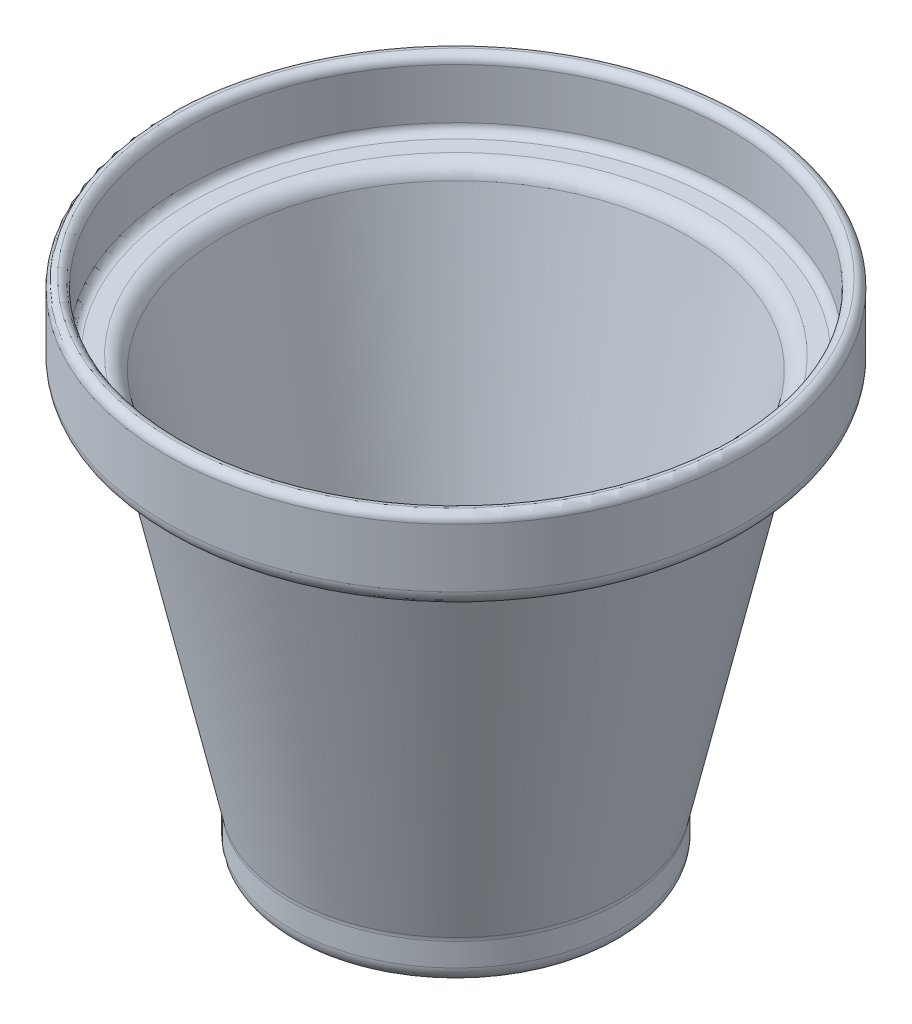
ISO-10303-21;
HEADER;
FILE_DESCRIPTION(('STEP AP214'),'2;1');
FILE_NAME('part.step','',(''),(''),'','','');
FILE_SCHEMA(('AUTOMOTIVE_DESIGN { 1 0 10303 214 1 1 1 1 }'));
ENDSEC;
DATA;
#1=APPLICATION_CONTEXT('core data for automotive mechanical design processes');
#2=APPLICATION_PROTOCOL_DEFINITION('international standard','automotive_design',2000,#1);
#3=PRODUCT_CONTEXT('',#1,'mechanical');
#4=PRODUCT('Part','Part','',(#3));
#5=PRODUCT_RELATED_PRODUCT_CATEGORY('part','',(#4));
#6=PRODUCT_DEFINITION_FORMATION('','',#4);
#7=PRODUCT_DEFINITION_CONTEXT('part definition',#1,'design');
#8=PRODUCT_DEFINITION('design','',#6,#7);
#9=PRODUCT_DEFINITION_SHAPE('','',#8);
#10=(LENGTH_UNIT() NAMED_UNIT(*) SI_UNIT(.MILLI.,.METRE.));
#11=(NAMED_UNIT(*) PLANE_ANGLE_UNIT() SI_UNIT($,.RADIAN.));
#12=(NAMED_UNIT(*) SI_UNIT($,.STERADIAN.) SOLID_ANGLE_UNIT());
#13=UNCERTAINTY_MEASURE_WITH_UNIT(LENGTH_MEASURE(1.E-05),#10,'distance_accuracy_value','');
#14=(GEOMETRIC_REPRESENTATION_CONTEXT(3) GLOBAL_UNCERTAINTY_ASSIGNED_CONTEXT((#13)) GLOBAL_UNIT_ASSIGNED_CONTEXT((#10,
#11,#12)) REPRESENTATION_CONTEXT('',''));
#15=CARTESIAN_POINT('',(0.,0.,0.));
#16=DIRECTION('',(0.,0.,1.));
#17=DIRECTION('',(1.,0.,0.));
#18=AXIS2_PLACEMENT_3D('',#15,#16,#17);
#19=CARTESIAN_POINT('',(0.,2.54,0.));
#20=DIRECTION('',(0.,1.,0.));
#21=DIRECTION('',(0.,0.,1.));
#22=AXIS2_PLACEMENT_3D('',#19,#20,#21);
#23=PLANE('',#22);
#24=CARTESIAN_POINT('',(0.,2.54,0.));
#25=DIRECTION('',(0.,1.,0.));
#26=DIRECTION('',(0.,0.,1.));
#27=AXIS2_PLACEMENT_3D('',#24,#25,#26);
#28=CIRCLE('',#27,21.59);
#29=CARTESIAN_POINT('',(0.,2.54,21.59));
#30=VERTEX_POINT('',#29);
#31=EDGE_CURVE('E52',#30,#30,#28,.T.);
#32=ORIENTED_EDGE('',*,*,#31,.T.);
#33=EDGE_LOOP('',(#32));
#34=FACE_BOUND('',#33,.T.);
#35=ADVANCED_FACE('F32',(#34),#23,.T.);
#36=CARTESIAN_POINT('',(0.,76.2,0.));
#37=DIRECTION('',(0.,-1.,0.));
#38=DIRECTION('',(0.,0.,-1.));
#39=AXIS2_PLACEMENT_3D('',#36,#37,#38);
#40=CYLINDRICAL_SURFACE('',#39,22.86);
#41=CARTESIAN_POINT('',(0.,6.21101845352427,0.));
#42=DIRECTION('',(0.,1.,0.));
#43=DIRECTION('',(0.,0.,1.));
#44=AXIS2_PLACEMENT_3D('',#41,#42,#43);
#45=CIRCLE('',#44,22.86);
#46=CARTESIAN_POINT('',(0.,6.21101845352427,22.86));
#47=VERTEX_POINT('',#46);
#48=EDGE_CURVE('E55',#47,#47,#45,.T.);
#49=ORIENTED_EDGE('',*,*,#48,.T.);
#50=EDGE_LOOP('',(#49));
#51=FACE_BOUND('',#50,.T.);
#52=CARTESIAN_POINT('',(0.,3.80999999999999,0.));
#53=DIRECTION('',(0.,1.,0.));
#54=DIRECTION('',(0.,0.,1.));
#55=AXIS2_PLACEMENT_3D('',#52,#53,#54);
#56=CIRCLE('',#55,22.86);
#57=CARTESIAN_POINT('',(0.,3.80999999999999,22.86));
#58=VERTEX_POINT('',#57);
#59=EDGE_CURVE('E58',#58,#58,#56,.F.);
#60=ORIENTED_EDGE('',*,*,#59,.T.);
#61=EDGE_LOOP('',(#60));
#62=FACE_BOUND('',#61,.T.);
#63=ADVANCED_FACE('F113',(#51,#62),#40,.F.);
#64=CARTESIAN_POINT('',(0.,65.9428182283601,0.));
#65=DIRECTION('',(0.,1.,0.));
#66=DIRECTION('',(0.,0.,1.));
#67=AXIS2_PLACEMENT_3D('',#64,#65,#66);
#68=CONICAL_SURFACE('',#67,36.061089782093,0.218001088599681);
#69=CARTESIAN_POINT('',(0.,6.48569209246498,0.));
#70=DIRECTION('',(0.,-1.,0.));
#71=DIRECTION('',(0.,0.,-1.));
#72=AXIS2_PLACEMENT_3D('',#69,#70,#71);
#73=CIRCLE('',#72,22.8900587142646);
#74=CARTESIAN_POINT('',(0.,6.48569209246498,-22.8900587142646));
#75=VERTEX_POINT('',#74);
#76=EDGE_CURVE('E61',#75,#75,#73,.T.);
#77=ORIENTED_EDGE('',*,*,#76,.T.);
#78=EDGE_LOOP('',(#77));
#79=FACE_BOUND('',#78,.T.);
#80=CARTESIAN_POINT('',(0.,63.9521655062416,0.));
#81=DIRECTION('',(0.,-1.,0.));
#82=DIRECTION('',(0.,0.,-1.));
#83=AXIS2_PLACEMENT_3D('',#80,#81,#82);
#84=CIRCLE('',#83,35.6201174285293);
#85=CARTESIAN_POINT('',(0.,63.9521655062416,-35.6201174285293));
#86=VERTEX_POINT('',#85);
#87=EDGE_CURVE('E73',#86,#86,#84,.F.);
#88=ORIENTED_EDGE('',*,*,#87,.T.);
#89=EDGE_LOOP('',(#88));
#90=FACE_BOUND('',#89,.T.);
#91=ADVANCED_FACE('F119',(#79,#90),#68,.F.);
#92=CARTESIAN_POINT('',(36.061089782093,65.9428182283601,0.));
#93=DIRECTION('',(0.,1.,0.));
#94=DIRECTION('',(0.,0.,1.));
#95=AXIS2_PLACEMENT_3D('',#92,#93,#94);
#96=PLANE('',#95);
#97=CARTESIAN_POINT('',(0.,65.9428182283601,0.));
#98=DIRECTION('',(0.,1.,0.));
#99=DIRECTION('',(0.,0.,1.));
#100=AXIS2_PLACEMENT_3D('',#97,#98,#99);
#101=CIRCLE('',#100,40.64);
#102=CARTESIAN_POINT('',(0.,65.9428182283601,40.64));
#103=VERTEX_POINT('',#102);
#104=EDGE_CURVE('E40',#103,#103,#101,.T.);
#105=ORIENTED_EDGE('',*,*,#104,.T.);
#106=EDGE_LOOP('',(#105));
#107=FACE_BOUND('',#106,.T.);
#108=CARTESIAN_POINT('',(0.,65.9428182283601,0.));
#109=DIRECTION('',(0.,1.,0.));
#110=DIRECTION('',(0.,0.,1.));
#111=AXIS2_PLACEMENT_3D('',#108,#109,#110);
#112=CIRCLE('',#111,38.1);
#113=CARTESIAN_POINT('',(0.,65.9428182283601,38.1));
#114=VERTEX_POINT('',#113);
#115=EDGE_CURVE('E76',#114,#114,#112,.F.);
#116=ORIENTED_EDGE('',*,*,#115,.T.);
#117=EDGE_LOOP('',(#116));
#118=FACE_BOUND('',#117,.T.);
#119=ADVANCED_FACE('F258',(#107,#118),#96,.T.);
#120=CARTESIAN_POINT('',(0.,76.2,0.));
#121=DIRECTION('',(0.,-1.,0.));
#122=DIRECTION('',(0.,0.,-1.));
#123=AXIS2_PLACEMENT_3D('',#120,#121,#122);
#124=CYLINDRICAL_SURFACE('',#123,41.91);
#125=CARTESIAN_POINT('',(0.,67.2128182283601,0.));
#126=DIRECTION('',(0.,1.,0.));
#127=DIRECTION('',(0.,0.,1.));
#128=AXIS2_PLACEMENT_3D('',#125,#126,#127);
#129=CIRCLE('',#128,41.91);
#130=CARTESIAN_POINT('',(0.,67.2128182283601,41.91));
#131=VERTEX_POINT('',#130);
#132=EDGE_CURVE('E44',#131,#131,#129,.F.);
#133=ORIENTED_EDGE('',*,*,#132,.T.);
#134=EDGE_LOOP('',(#133));
#135=FACE_BOUND('',#134,.T.);
#136=CARTESIAN_POINT('',(0.,74.93,0.));
#137=DIRECTION('',(0.,1.,0.));
#138=DIRECTION('',(0.,0.,1.));
#139=AXIS2_PLACEMENT_3D('',#136,#137,#138);
#140=CIRCLE('',#139,41.91);
#141=CARTESIAN_POINT('',(0.,74.93,41.91));
#142=VERTEX_POINT('',#141);
#143=EDGE_CURVE('E49',#142,#142,#140,.T.);
#144=ORIENTED_EDGE('',*,*,#143,.T.);
#145=EDGE_LOOP('',(#144));
#146=FACE_BOUND('',#145,.T.);
#147=ADVANCED_FACE('F250',(#135,#146),#124,.F.);
#148=CARTESIAN_POINT('',(0.,76.2,0.));
#149=DIRECTION('',(0.,-1.,0.));
#150=DIRECTION('',(0.,0.,-1.));
#151=AXIS2_PLACEMENT_3D('',#148,#149,#150);
#152=CYLINDRICAL_SURFACE('',#151,44.45);
#153=CARTESIAN_POINT('',(0.,74.93,0.));
#154=DIRECTION('',(0.,1.,0.));
#155=DIRECTION('',(0.,0.,1.));
#156=AXIS2_PLACEMENT_3D('',#153,#154,#155);
#157=CIRCLE('',#156,44.45);
#158=CARTESIAN_POINT('',(0.,74.93,44.45));
#159=VERTEX_POINT('',#158);
#160=EDGE_CURVE('E10',#159,#159,#157,.F.);
#161=ORIENTED_EDGE('',*,*,#160,.T.);
#162=EDGE_LOOP('',(#161));
#163=FACE_BOUND('',#162,.T.);
#164=CARTESIAN_POINT('',(0.,65.9428182283601,0.));
#165=DIRECTION('',(0.,-1.,0.));
#166=DIRECTION('',(0.,0.,-1.));
#167=AXIS2_PLACEMENT_3D('',#164,#165,#166);
#168=CIRCLE('',#167,44.45);
#169=CARTESIAN_POINT('',(0.,65.9428182283601,-44.45));
#170=VERTEX_POINT('',#169);
#171=EDGE_CURVE('E79',#170,#170,#168,.F.);
#172=ORIENTED_EDGE('',*,*,#171,.T.);
#173=EDGE_LOOP('',(#172));
#174=FACE_BOUND('',#173,.T.);
#175=ADVANCED_FACE('F242',(#163,#174),#152,.T.);
#176=CARTESIAN_POINT('',(38.1,63.4028182283601,0.));
#177=DIRECTION('',(0.,-1.,0.));
#178=DIRECTION('',(0.,0.,-1.));
#179=AXIS2_PLACEMENT_3D('',#176,#177,#178);
#180=PLANE('',#179);
#181=CARTESIAN_POINT('',(0.,63.4028182283601,0.));
#182=DIRECTION('',(0.,-1.,0.));
#183=DIRECTION('',(0.,0.,-1.));
#184=AXIS2_PLACEMENT_3D('',#181,#182,#183);
#185=CIRCLE('',#184,40.13676316339);
#186=CARTESIAN_POINT('',(0.,63.4028182283601,-40.13676316339));
#187=VERTEX_POINT('',#186);
#188=EDGE_CURVE('E82',#187,#187,#185,.F.);
#189=ORIENTED_EDGE('',*,*,#188,.T.);
#190=EDGE_LOOP('',(#189));
#191=FACE_BOUND('',#190,.T.);
#192=CARTESIAN_POINT('',(0.,63.4028182283601,0.));
#193=DIRECTION('',(0.,-1.,0.));
#194=DIRECTION('',(0.,0.,-1.));
#195=AXIS2_PLACEMENT_3D('',#192,#193,#194);
#196=CIRCLE('',#195,41.91);
#197=CARTESIAN_POINT('',(0.,63.4028182283601,-41.91));
#198=VERTEX_POINT('',#197);
#199=EDGE_CURVE('E85',#198,#198,#196,.T.);
#200=ORIENTED_EDGE('',*,*,#199,.T.);
#201=EDGE_LOOP('',(#200));
#202=FACE_BOUND('',#201,.T.);
#203=ADVANCED_FACE('F233',(#191,#202),#180,.T.);
#204=CARTESIAN_POINT('',(0.,6.34999999999999,0.));
#205=DIRECTION('',(0.,1.,0.));
#206=DIRECTION('',(0.,0.,1.));
#207=AXIS2_PLACEMENT_3D('',#204,#205,#206);
#208=CONICAL_SURFACE('',#207,25.4,0.219029629527002);
#209=CARTESIAN_POINT('',(0.,61.4147158759353,0.));
#210=DIRECTION('',(0.,1.,0.));
#211=DIRECTION('',(0.,0.,1.));
#212=AXIS2_PLACEMENT_3D('',#209,#210,#211);
#213=CIRCLE('',#212,37.6574469297076);
#214=CARTESIAN_POINT('',(0.,61.4147158759353,37.6574469297076));
#215=VERTEX_POINT('',#214);
#216=EDGE_CURVE('E88',#215,#215,#213,.F.);
#217=ORIENTED_EDGE('',*,*,#216,.T.);
#218=EDGE_LOOP('',(#217));
#219=FACE_BOUND('',#218,.T.);
#220=CARTESIAN_POINT('',(0.,6.62261258969539,0.));
#221=DIRECTION('',(0.,1.,0.));
#222=DIRECTION('',(0.,0.,1.));
#223=AXIS2_PLACEMENT_3D('',#220,#221,#222);
#224=CIRCLE('',#223,25.4606837663176);
#225=CARTESIAN_POINT('',(0.,6.62261258969539,25.4606837663176));
#226=VERTEX_POINT('',#225);
#227=EDGE_CURVE('E91',#226,#226,#224,.T.);
#228=ORIENTED_EDGE('',*,*,#227,.T.);
#229=EDGE_LOOP('',(#228));
#230=FACE_BOUND('',#229,.T.);
#231=ADVANCED_FACE('F224',(#219,#230),#208,.T.);
#232=CARTESIAN_POINT('',(0.,76.2,0.));
#233=DIRECTION('',(0.,-1.,0.));
#234=DIRECTION('',(0.,0.,-1.));
#235=AXIS2_PLACEMENT_3D('',#232,#233,#234);
#236=CYLINDRICAL_SURFACE('',#235,25.4);
#237=CARTESIAN_POINT('',(0.,2.54,0.));
#238=DIRECTION('',(0.,-1.,0.));
#239=DIRECTION('',(0.,0.,-1.));
#240=AXIS2_PLACEMENT_3D('',#237,#238,#239);
#241=CIRCLE('',#240,25.4);
#242=CARTESIAN_POINT('',(0.,2.54,-25.4));
#243=VERTEX_POINT('',#242);
#244=EDGE_CURVE('E64',#243,#243,#241,.F.);
#245=ORIENTED_EDGE('',*,*,#244,.T.);
#246=EDGE_LOOP('',(#245));
#247=FACE_BOUND('',#246,.T.);
#248=CARTESIAN_POINT('',(0.,6.07071494212021,0.));
#249=DIRECTION('',(0.,-1.,0.));
#250=DIRECTION('',(0.,0.,-1.));
#251=AXIS2_PLACEMENT_3D('',#248,#249,#250);
#252=CIRCLE('',#251,25.4);
#253=CARTESIAN_POINT('',(0.,6.07071494212021,-25.4));
#254=VERTEX_POINT('',#253);
#255=EDGE_CURVE('E67',#254,#254,#252,.T.);
#256=ORIENTED_EDGE('',*,*,#255,.T.);
#257=EDGE_LOOP('',(#256));
#258=FACE_BOUND('',#257,.T.);
#259=ADVANCED_FACE('F215',(#247,#258),#236,.T.);
#260=CARTESIAN_POINT('',(0.,0.,0.));
#261=DIRECTION('',(0.,-1.,0.));
#262=DIRECTION('',(0.,0.,-1.));
#263=AXIS2_PLACEMENT_3D('',#260,#261,#262);
#264=PLANE('',#263);
#265=CARTESIAN_POINT('',(0.,0.,0.));
#266=DIRECTION('',(0.,-1.,0.));
#267=DIRECTION('',(0.,0.,-1.));
#268=AXIS2_PLACEMENT_3D('',#265,#266,#267);
#269=CIRCLE('',#268,22.86);
#270=CARTESIAN_POINT('',(0.,0.,-22.86));
#271=VERTEX_POINT('',#270);
#272=EDGE_CURVE('E70',#271,#271,#269,.T.);
#273=ORIENTED_EDGE('',*,*,#272,.T.);
#274=EDGE_LOOP('',(#273));
#275=FACE_BOUND('',#274,.T.);
#276=ADVANCED_FACE('F128',(#275),#264,.T.);
#277=CARTESIAN_POINT('',(0.,60.8628182283601,0.));
#278=DIRECTION('',(0.,-1.,0.));
#279=DIRECTION('',(0.,0.,-1.));
#280=AXIS2_PLACEMENT_3D('',#277,#278,#279);
#281=TOROIDAL_SURFACE('',#280,40.13676316339,2.54);
#282=ORIENTED_EDGE('',*,*,#188,.F.);
#283=EDGE_LOOP('',(#282));
#284=FACE_BOUND('',#283,.T.);
#285=ORIENTED_EDGE('',*,*,#216,.F.);
#286=EDGE_LOOP('',(#285));
#287=FACE_BOUND('',#286,.T.);
#288=ADVANCED_FACE('F124',(#284,#287),#281,.F.);
#289=CARTESIAN_POINT('',(0.,65.9428182283601,0.));
#290=DIRECTION('',(0.,-1.,0.));
#291=DIRECTION('',(0.,0.,-1.));
#292=AXIS2_PLACEMENT_3D('',#289,#290,#291);
#293=TOROIDAL_SURFACE('',#292,41.91,2.54);
#294=ORIENTED_EDGE('',*,*,#171,.F.);
#295=EDGE_LOOP('',(#294));
#296=FACE_BOUND('',#295,.T.);
#297=ORIENTED_EDGE('',*,*,#199,.F.);
#298=EDGE_LOOP('',(#297));
#299=FACE_BOUND('',#298,.T.);
#300=ADVANCED_FACE('F127',(#296,#299),#293,.T.);
#301=CARTESIAN_POINT('',(0.,63.4028182283601,0.));
#302=DIRECTION('',(0.,1.,0.));
#303=DIRECTION('',(0.,0.,1.));
#304=AXIS2_PLACEMENT_3D('',#301,#302,#303);
#305=TOROIDAL_SURFACE('',#304,38.1,2.54);
#306=ORIENTED_EDGE('',*,*,#87,.F.);
#307=EDGE_LOOP('',(#306));
#308=FACE_BOUND('',#307,.T.);
#309=ORIENTED_EDGE('',*,*,#115,.F.);
#310=EDGE_LOOP('',(#309));
#311=FACE_BOUND('',#310,.T.);
#312=ADVANCED_FACE('F132',(#308,#311),#305,.T.);
#313=CARTESIAN_POINT('',(0.,2.54,0.));
#314=DIRECTION('',(0.,-1.,0.));
#315=DIRECTION('',(0.,0.,-1.));
#316=AXIS2_PLACEMENT_3D('',#313,#314,#315);
#317=TOROIDAL_SURFACE('',#316,22.86,2.54);
#318=ORIENTED_EDGE('',*,*,#244,.F.);
#319=EDGE_LOOP('',(#318));
#320=FACE_BOUND('',#319,.T.);
#321=ORIENTED_EDGE('',*,*,#272,.F.);
#322=EDGE_LOOP('',(#321));
#323=FACE_BOUND('',#322,.T.);
#324=ADVANCED_FACE('F136',(#320,#323),#317,.T.);
#325=CARTESIAN_POINT('',(0.,6.07071494212021,0.));
#326=DIRECTION('',(0.,-1.,0.));
#327=DIRECTION('',(0.,0.,-1.));
#328=AXIS2_PLACEMENT_3D('',#325,#326,#327);
#329=TOROIDAL_SURFACE('',#328,27.94,2.54);
#330=ORIENTED_EDGE('',*,*,#227,.F.);
#331=EDGE_LOOP('',(#330));
#332=FACE_BOUND('',#331,.T.);
#333=ORIENTED_EDGE('',*,*,#255,.F.);
#334=EDGE_LOOP('',(#333));
#335=FACE_BOUND('',#334,.T.);
#336=ADVANCED_FACE('F140',(#332,#335),#329,.F.);
#337=CARTESIAN_POINT('',(0.,6.21101845352427,0.));
#338=DIRECTION('',(0.,1.,0.));
#339=DIRECTION('',(0.,0.,1.));
#340=AXIS2_PLACEMENT_3D('',#337,#338,#339);
#341=TOROIDAL_SURFACE('',#340,24.13,1.27);
#342=ORIENTED_EDGE('',*,*,#48,.F.);
#343=EDGE_LOOP('',(#342));
#344=FACE_BOUND('',#343,.T.);
#345=ORIENTED_EDGE('',*,*,#76,.F.);
#346=EDGE_LOOP('',(#345));
#347=FACE_BOUND('',#346,.T.);
#348=ADVANCED_FACE('F144',(#344,#347),#341,.T.);
#349=CARTESIAN_POINT('',(0.,3.80999999999999,0.));
#350=DIRECTION('',(0.,1.,0.));
#351=DIRECTION('',(0.,0.,1.));
#352=AXIS2_PLACEMENT_3D('',#349,#350,#351);
#353=TOROIDAL_SURFACE('',#352,21.59,1.27);
#354=ORIENTED_EDGE('',*,*,#31,.F.);
#355=EDGE_LOOP('',(#354));
#356=FACE_BOUND('',#355,.T.);
#357=ORIENTED_EDGE('',*,*,#59,.F.);
#358=EDGE_LOOP('',(#357));
#359=FACE_BOUND('',#358,.T.);
#360=ADVANCED_FACE('F108',(#356,#359),#353,.F.);
#361=CARTESIAN_POINT('',(0.,67.2128182283601,0.));
#362=DIRECTION('',(0.,1.,0.));
#363=DIRECTION('',(0.,0.,1.));
#364=AXIS2_PLACEMENT_3D('',#361,#362,#363);
#365=TOROIDAL_SURFACE('',#364,40.64,1.27);
#366=ORIENTED_EDGE('',*,*,#104,.F.);
#367=EDGE_LOOP('',(#366));
#368=FACE_BOUND('',#367,.T.);
#369=ORIENTED_EDGE('',*,*,#132,.F.);
#370=EDGE_LOOP('',(#369));
#371=FACE_BOUND('',#370,.T.);
#372=ADVANCED_FACE('F102',(#368,#371),#365,.F.);
#373=CARTESIAN_POINT('',(0.,74.93,0.));
#374=DIRECTION('',(0.,1.,0.));
#375=DIRECTION('',(0.,0.,1.));
#376=AXIS2_PLACEMENT_3D('',#373,#374,#375);
#377=TOROIDAL_SURFACE('',#376,43.18,1.27);
#378=ORIENTED_EDGE('',*,*,#143,.F.);
#379=EDGE_LOOP('',(#378));
#380=FACE_BOUND('',#379,.T.);
#381=CARTESIAN_POINT('',(0.,76.2,0.));
#382=DIRECTION('',(0.,1.,0.));
#383=DIRECTION('',(0.,0.,1.));
#384=AXIS2_PLACEMENT_3D('',#381,#382,#383);
#385=CIRCLE('',#384,43.18);
#386=CARTESIAN_POINT('',(0.,76.2,43.18));
#387=VERTEX_POINT('',#386);
#388=EDGE_CURVE('E36',#387,#387,#385,.F.);
#389=ORIENTED_EDGE('',*,*,#388,.F.);
#390=EDGE_LOOP('',(#389));
#391=FACE_BOUND('',#390,.T.);
#392=ADVANCED_FACE('F34',(#380,#391),#377,.T.);
#393=CARTESIAN_POINT('',(0.,74.93,0.));
#394=DIRECTION('',(0.,1.,0.));
#395=DIRECTION('',(0.,0.,1.));
#396=AXIS2_PLACEMENT_3D('',#393,#394,#395);
#397=TOROIDAL_SURFACE('',#396,43.18,1.27);
#398=ORIENTED_EDGE('',*,*,#388,.T.);
#399=EDGE_LOOP('',(#398));
#400=FACE_BOUND('',#399,.T.);
#401=ORIENTED_EDGE('',*,*,#160,.F.);
#402=EDGE_LOOP('',(#401));
#403=FACE_BOUND('',#402,.T.);
#404=ADVANCED_FACE('F98',(#400,#403),#397,.T.);
#405=CLOSED_SHELL('',(#35,#63,#91,#119,#147,#175,#203,#231,#259,#276,#288,#300,#312,#324,#336,
#348,#360,#372,#392,#404));
#406=MANIFOLD_SOLID_BREP('B2',#405);
#407=ADVANCED_BREP_SHAPE_REPRESENTATION('',(#18,#406),#14);
#408=SHAPE_DEFINITION_REPRESENTATION(#9,#407);
ENDSEC;
END-ISO-10303-21;
